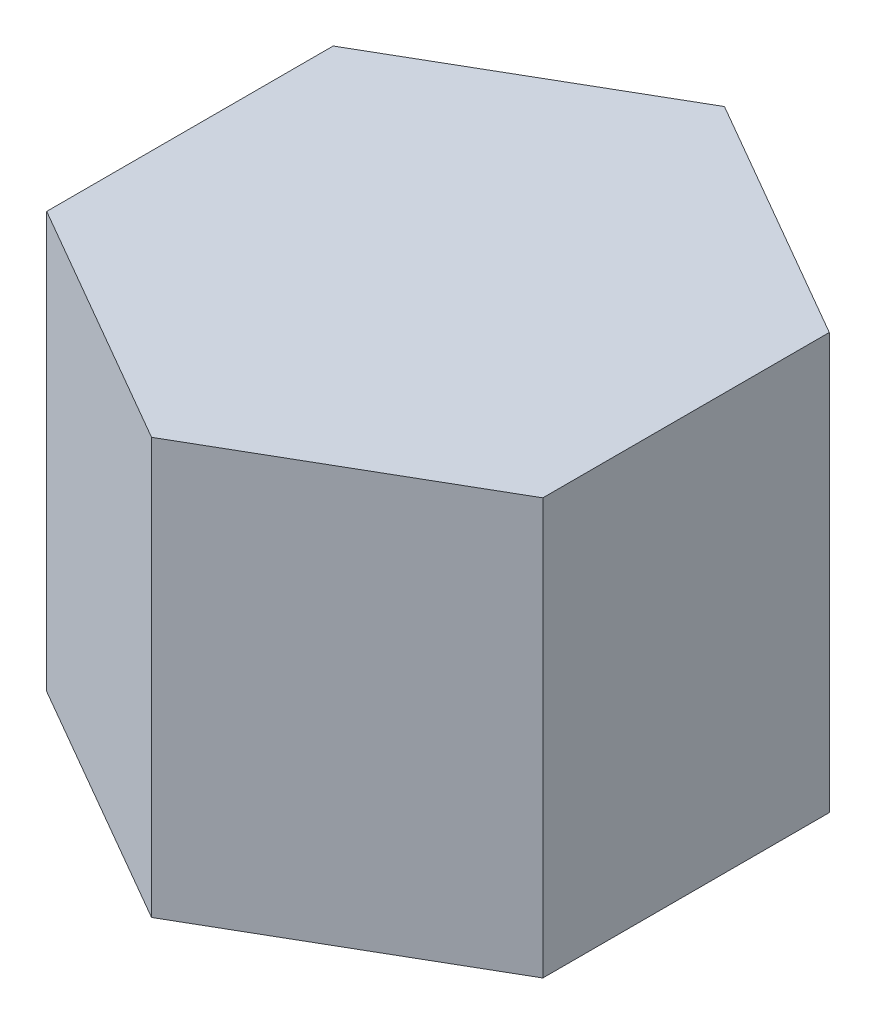
ISO-10303-21;
HEADER;
FILE_DESCRIPTION(('STEP AP214'),'2;1');
FILE_NAME('part.step','',(''),(''),'','','');
FILE_SCHEMA(('AUTOMOTIVE_DESIGN { 1 0 10303 214 1 1 1 1 }'));
ENDSEC;
DATA;
#1=APPLICATION_CONTEXT('core data for automotive mechanical design processes');
#2=APPLICATION_PROTOCOL_DEFINITION('international standard','automotive_design',2000,#1);
#3=PRODUCT_CONTEXT('',#1,'mechanical');
#4=PRODUCT('Part','Part','',(#3));
#5=PRODUCT_RELATED_PRODUCT_CATEGORY('part','',(#4));
#6=PRODUCT_DEFINITION_FORMATION('','',#4);
#7=PRODUCT_DEFINITION_CONTEXT('part definition',#1,'design');
#8=PRODUCT_DEFINITION('design','',#6,#7);
#9=PRODUCT_DEFINITION_SHAPE('','',#8);
#10=(LENGTH_UNIT() NAMED_UNIT(*) SI_UNIT(.MILLI.,.METRE.));
#11=(NAMED_UNIT(*) PLANE_ANGLE_UNIT() SI_UNIT($,.RADIAN.));
#12=(NAMED_UNIT(*) SI_UNIT($,.STERADIAN.) SOLID_ANGLE_UNIT());
#13=UNCERTAINTY_MEASURE_WITH_UNIT(LENGTH_MEASURE(1.E-05),#10,'distance_accuracy_value','');
#14=(GEOMETRIC_REPRESENTATION_CONTEXT(3) GLOBAL_UNCERTAINTY_ASSIGNED_CONTEXT((#13)) GLOBAL_UNIT_ASSIGNED_CONTEXT((#10,
#11,#12)) REPRESENTATION_CONTEXT('',''));
#15=CARTESIAN_POINT('',(0.,0.,0.));
#16=DIRECTION('',(0.,0.,1.));
#17=DIRECTION('',(1.,0.,0.));
#18=AXIS2_PLACEMENT_3D('',#15,#16,#17);
#19=CARTESIAN_POINT('',(203.142660308706,-148.537700895744,295.837098239417));
#20=DIRECTION('',(-0.499999999999943,0.,-0.866025403784472));
#21=DIRECTION('',(-0.866025403784472,0.,0.499999999999943));
#22=AXIS2_PLACEMENT_3D('',#19,#20,#21);
#23=PLANE('',#22);
#24=CARTESIAN_POINT('',(202.839551417381,-149.045793579175,296.012098239417));
#25=DIRECTION('',(0.866025403784471,0.,-0.499999999999943));
#26=VECTOR('',#25,1.);
#27=LINE('',#24,#26);
#28=CARTESIAN_POINT('',(202.839551417382,-149.045793579175,296.012098239417));
#29=VERTEX_POINT('',#28);
#30=CARTESIAN_POINT('',(203.142660308706,-149.045793579175,295.837098239417));
#31=VERTEX_POINT('',#30);
#32=EDGE_CURVE('E170',#29,#31,#27,.T.);
#33=ORIENTED_EDGE('',*,*,#32,.T.);
#34=CARTESIAN_POINT('',(203.142660308706,-148.537700895744,295.837098239417));
#35=DIRECTION('',(0.,-1.,0.));
#36=VECTOR('',#35,1.);
#37=LINE('',#34,#36);
#38=CARTESIAN_POINT('',(203.142660308706,-148.537700895744,295.837098239417));
#39=VERTEX_POINT('',#38);
#40=EDGE_CURVE('E35',#39,#31,#37,.T.);
#41=ORIENTED_EDGE('',*,*,#40,.F.);
#42=CARTESIAN_POINT('',(202.839551417381,-148.537700895744,296.012098239417));
#43=DIRECTION('',(0.866025403784471,0.,-0.499999999999943));
#44=VECTOR('',#43,1.);
#45=LINE('',#42,#44);
#46=CARTESIAN_POINT('',(202.839551417382,-148.537700895744,296.012098239417));
#47=VERTEX_POINT('',#46);
#48=EDGE_CURVE('E159',#47,#39,#45,.T.);
#49=ORIENTED_EDGE('',*,*,#48,.F.);
#50=CARTESIAN_POINT('',(202.839551417381,-148.537700895744,296.012098239417));
#51=DIRECTION('',(0.,-1.,0.));
#52=VECTOR('',#51,1.);
#53=LINE('',#50,#52);
#54=EDGE_CURVE('E10',#47,#29,#53,.T.);
#55=ORIENTED_EDGE('',*,*,#54,.T.);
#56=EDGE_LOOP('',(#33,#41,#49,#55));
#57=FACE_BOUND('',#56,.T.);
#58=ADVANCED_FACE('F16',(#57),#23,.F.);
#59=CARTESIAN_POINT('',(202.839551417382,-148.537700895744,296.012098239417));
#60=DIRECTION('',(0.499999999999978,0.,-0.866025403784452));
#61=DIRECTION('',(-0.866025403784452,0.,-0.499999999999978));
#62=AXIS2_PLACEMENT_3D('',#59,#60,#61);
#63=PLANE('',#62);
#64=CARTESIAN_POINT('',(202.536442526057,-149.045793579175,295.837098239417));
#65=DIRECTION('',(0.866025403784452,0.,0.499999999999978));
#66=VECTOR('',#65,1.);
#67=LINE('',#64,#66);
#68=CARTESIAN_POINT('',(202.536442526057,-149.045793579175,295.837098239417));
#69=VERTEX_POINT('',#68);
#70=EDGE_CURVE('E167',#69,#29,#67,.T.);
#71=ORIENTED_EDGE('',*,*,#70,.T.);
#72=ORIENTED_EDGE('',*,*,#54,.F.);
#73=CARTESIAN_POINT('',(202.536442526057,-148.537700895744,295.837098239417));
#74=DIRECTION('',(0.866025403784452,0.,0.499999999999978));
#75=VECTOR('',#74,1.);
#76=LINE('',#73,#75);
#77=CARTESIAN_POINT('',(202.536442526057,-148.537700895744,295.837098239417));
#78=VERTEX_POINT('',#77);
#79=EDGE_CURVE('E156',#78,#47,#76,.T.);
#80=ORIENTED_EDGE('',*,*,#79,.F.);
#81=CARTESIAN_POINT('',(202.536442526057,-148.537700895744,295.837098239417));
#82=DIRECTION('',(0.,-1.,0.));
#83=VECTOR('',#82,1.);
#84=LINE('',#81,#83);
#85=EDGE_CURVE('E27',#78,#69,#84,.T.);
#86=ORIENTED_EDGE('',*,*,#85,.T.);
#87=EDGE_LOOP('',(#71,#72,#80,#86));
#88=FACE_BOUND('',#87,.T.);
#89=ADVANCED_FACE('F189',(#88),#63,.F.);
#90=CARTESIAN_POINT('',(202.536442526057,-148.537700895744,290.831971220494));
#91=DIRECTION('',(1.,0.,0.));
#92=DIRECTION('',(0.,1.,0.));
#93=AXIS2_PLACEMENT_3D('',#90,#91,#92);
#94=PLANE('',#93);
#95=CARTESIAN_POINT('',(202.536442526057,-149.045793579175,295.487098239417));
#96=DIRECTION('',(0.,0.,1.));
#97=VECTOR('',#96,1.);
#98=LINE('',#95,#97);
#99=CARTESIAN_POINT('',(202.536442526057,-149.045793579175,295.487098239417));
#100=VERTEX_POINT('',#99);
#101=EDGE_CURVE('E163',#100,#69,#98,.T.);
#102=ORIENTED_EDGE('',*,*,#101,.T.);
#103=ORIENTED_EDGE('',*,*,#85,.F.);
#104=CARTESIAN_POINT('',(202.536442526057,-148.537700895744,295.487098239417));
#105=DIRECTION('',(0.,0.,1.));
#106=VECTOR('',#105,1.);
#107=LINE('',#104,#106);
#108=CARTESIAN_POINT('',(202.536442526057,-148.537700895744,295.487098239417));
#109=VERTEX_POINT('',#108);
#110=EDGE_CURVE('E106',#109,#78,#107,.T.);
#111=ORIENTED_EDGE('',*,*,#110,.F.);
#112=CARTESIAN_POINT('',(202.536442526057,-148.537700895744,295.487098239417));
#113=DIRECTION('',(0.,-1.,0.));
#114=VECTOR('',#113,1.);
#115=LINE('',#112,#114);
#116=EDGE_CURVE('E94',#109,#100,#115,.T.);
#117=ORIENTED_EDGE('',*,*,#116,.T.);
#118=EDGE_LOOP('',(#102,#103,#111,#117));
#119=FACE_BOUND('',#118,.T.);
#120=ADVANCED_FACE('F198',(#119),#94,.F.);
#121=CARTESIAN_POINT('',(202.536442526057,-148.537700895744,295.487098239417));
#122=DIRECTION('',(0.499999999999978,0.,0.866025403784452));
#123=DIRECTION('',(0.866025403784452,0.,-0.499999999999978));
#124=AXIS2_PLACEMENT_3D('',#121,#122,#123);
#125=PLANE('',#124);
#126=CARTESIAN_POINT('',(202.839551417382,-149.045793579175,295.312098239417));
#127=DIRECTION('',(-0.866025403784452,0.,0.499999999999978));
#128=VECTOR('',#127,1.);
#129=LINE('',#126,#128);
#130=CARTESIAN_POINT('',(202.839551417382,-149.045793579175,295.312098239417));
#131=VERTEX_POINT('',#130);
#132=EDGE_CURVE('E162',#131,#100,#129,.T.);
#133=ORIENTED_EDGE('',*,*,#132,.T.);
#134=ORIENTED_EDGE('',*,*,#116,.F.);
#135=CARTESIAN_POINT('',(202.839551417382,-148.537700895744,295.312098239417));
#136=DIRECTION('',(-0.866025403784452,0.,0.499999999999978));
#137=VECTOR('',#136,1.);
#138=LINE('',#135,#137);
#139=CARTESIAN_POINT('',(202.839551417382,-148.537700895744,295.312098239417));
#140=VERTEX_POINT('',#139);
#141=EDGE_CURVE('E98',#140,#109,#138,.T.);
#142=ORIENTED_EDGE('',*,*,#141,.F.);
#143=CARTESIAN_POINT('',(202.839551417382,-148.537700895744,295.312098239417));
#144=DIRECTION('',(0.,-1.,0.));
#145=VECTOR('',#144,1.);
#146=LINE('',#143,#145);
#147=EDGE_CURVE('E79',#140,#131,#146,.T.);
#148=ORIENTED_EDGE('',*,*,#147,.T.);
#149=EDGE_LOOP('',(#133,#134,#142,#148));
#150=FACE_BOUND('',#149,.T.);
#151=ADVANCED_FACE('F100',(#150),#125,.F.);
#152=CARTESIAN_POINT('',(202.839551417382,-148.537700895744,295.312098239417));
#153=DIRECTION('',(-0.500000000000096,0.,0.866025403784383));
#154=DIRECTION('',(0.866025403784383,0.,0.500000000000096));
#155=AXIS2_PLACEMENT_3D('',#152,#153,#154);
#156=PLANE('',#155);
#157=CARTESIAN_POINT('',(203.142660308706,-149.045793579175,295.487098239417));
#158=DIRECTION('',(-0.866025403784383,0.,-0.500000000000096));
#159=VECTOR('',#158,1.);
#160=LINE('',#157,#159);
#161=CARTESIAN_POINT('',(203.142660308706,-149.045793579175,295.487098239417));
#162=VERTEX_POINT('',#161);
#163=EDGE_CURVE('E88',#162,#131,#160,.T.);
#164=ORIENTED_EDGE('',*,*,#163,.T.);
#165=ORIENTED_EDGE('',*,*,#147,.F.);
#166=CARTESIAN_POINT('',(203.142660308706,-148.537700895744,295.487098239417));
#167=DIRECTION('',(-0.866025403784383,0.,-0.500000000000096));
#168=VECTOR('',#167,1.);
#169=LINE('',#166,#168);
#170=CARTESIAN_POINT('',(203.142660308706,-148.537700895744,295.487098239417));
#171=VERTEX_POINT('',#170);
#172=EDGE_CURVE('E84',#171,#140,#169,.T.);
#173=ORIENTED_EDGE('',*,*,#172,.F.);
#174=CARTESIAN_POINT('',(203.142660308706,-148.537700895744,295.487098239417));
#175=DIRECTION('',(0.,-1.,0.));
#176=VECTOR('',#175,1.);
#177=LINE('',#174,#176);
#178=EDGE_CURVE('E58',#171,#162,#177,.T.);
#179=ORIENTED_EDGE('',*,*,#178,.T.);
#180=EDGE_LOOP('',(#164,#165,#173,#179));
#181=FACE_BOUND('',#180,.T.);
#182=ADVANCED_FACE('F82',(#181),#156,.F.);
#183=CARTESIAN_POINT('',(203.142660308706,-148.537700895744,290.831971220494));
#184=DIRECTION('',(-1.,0.,0.));
#185=DIRECTION('',(0.,-1.,0.));
#186=AXIS2_PLACEMENT_3D('',#183,#184,#185);
#187=PLANE('',#186);
#188=CARTESIAN_POINT('',(203.142660308706,-149.045793579175,295.837098239417));
#189=DIRECTION('',(0.,0.,-1.));
#190=VECTOR('',#189,1.);
#191=LINE('',#188,#190);
#192=EDGE_CURVE('E160',#31,#162,#191,.T.);
#193=ORIENTED_EDGE('',*,*,#192,.T.);
#194=ORIENTED_EDGE('',*,*,#178,.F.);
#195=CARTESIAN_POINT('',(203.142660308706,-148.537700895744,295.837098239417));
#196=DIRECTION('',(0.,0.,-1.));
#197=VECTOR('',#196,1.);
#198=LINE('',#195,#197);
#199=EDGE_CURVE('E112',#39,#171,#198,.T.);
#200=ORIENTED_EDGE('',*,*,#199,.F.);
#201=ORIENTED_EDGE('',*,*,#40,.T.);
#202=EDGE_LOOP('',(#193,#194,#200,#201));
#203=FACE_BOUND('',#202,.T.);
#204=ADVANCED_FACE('F131',(#203),#187,.F.);
#205=CARTESIAN_POINT('',(206.339551417382,-148.537700895744,290.831971220494));
#206=DIRECTION('',(0.,-1.,0.));
#207=DIRECTION('',(1.,0.,0.));
#208=AXIS2_PLACEMENT_3D('',#205,#206,#207);
#209=PLANE('',#208);
#210=ORIENTED_EDGE('',*,*,#48,.T.);
#211=ORIENTED_EDGE('',*,*,#199,.T.);
#212=ORIENTED_EDGE('',*,*,#172,.T.);
#213=ORIENTED_EDGE('',*,*,#141,.T.);
#214=ORIENTED_EDGE('',*,*,#110,.T.);
#215=ORIENTED_EDGE('',*,*,#79,.T.);
#216=EDGE_LOOP('',(#210,#211,#212,#213,#214,#215));
#217=FACE_BOUND('',#216,.T.);
#218=ADVANCED_FACE('F111',(#217),#209,.F.);
#219=CARTESIAN_POINT('',(206.339551417382,-149.045793579175,290.831971220494));
#220=DIRECTION('',(0.,-1.,0.));
#221=DIRECTION('',(1.,0.,0.));
#222=AXIS2_PLACEMENT_3D('',#219,#220,#221);
#223=PLANE('',#222);
#224=ORIENTED_EDGE('',*,*,#32,.F.);
#225=ORIENTED_EDGE('',*,*,#70,.F.);
#226=ORIENTED_EDGE('',*,*,#101,.F.);
#227=ORIENTED_EDGE('',*,*,#132,.F.);
#228=ORIENTED_EDGE('',*,*,#163,.F.);
#229=ORIENTED_EDGE('',*,*,#192,.F.);
#230=EDGE_LOOP('',(#224,#225,#226,#227,#228,#229));
#231=FACE_BOUND('',#230,.T.);
#232=ADVANCED_FACE('F130',(#231),#223,.T.);
#233=CLOSED_SHELL('',(#58,#89,#120,#151,#182,#204,#218,#232));
#234=MANIFOLD_SOLID_BREP('B1',#233);
#235=ADVANCED_BREP_SHAPE_REPRESENTATION('',(#18,#234),#14);
#236=SHAPE_DEFINITION_REPRESENTATION(#9,#235);
ENDSEC;
END-ISO-10303-21;
